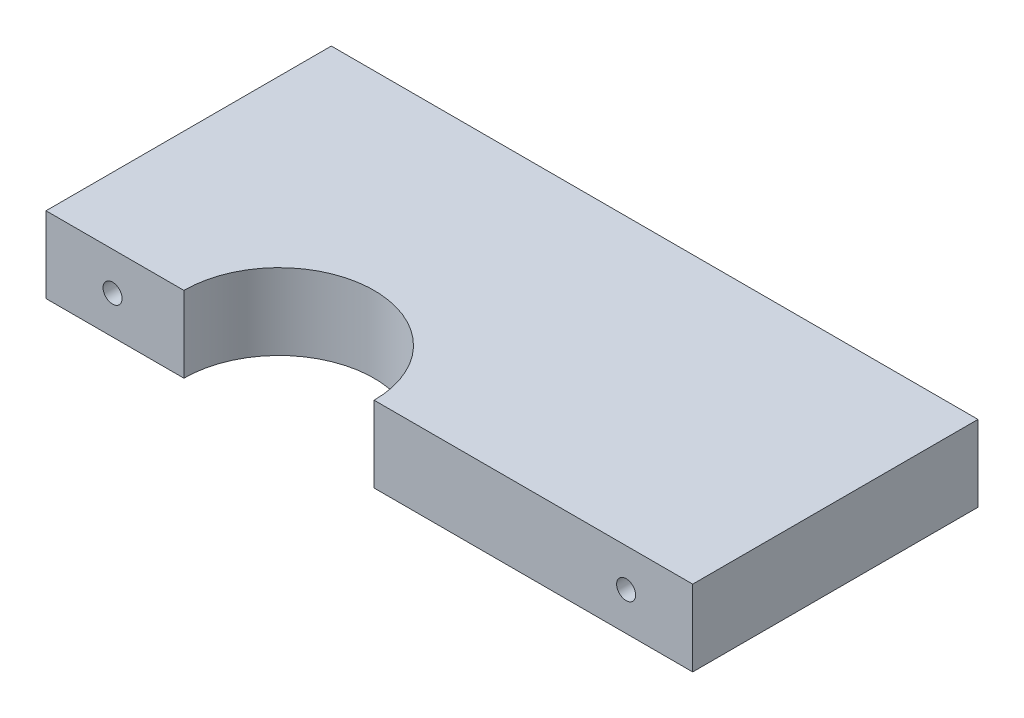
ISO-10303-21;
HEADER;
FILE_DESCRIPTION(('STEP AP214'),'2;1');
FILE_NAME('part.step','',(''),(''),'','','');
FILE_SCHEMA(('AUTOMOTIVE_DESIGN { 1 0 10303 214 1 1 1 1 }'));
ENDSEC;
DATA;
#1=APPLICATION_CONTEXT('core data for automotive mechanical design processes');
#2=APPLICATION_PROTOCOL_DEFINITION('international standard','automotive_design',2000,#1);
#3=PRODUCT_CONTEXT('',#1,'mechanical');
#4=PRODUCT('Part','Part','',(#3));
#5=PRODUCT_RELATED_PRODUCT_CATEGORY('part','',(#4));
#6=PRODUCT_DEFINITION_FORMATION('','',#4);
#7=PRODUCT_DEFINITION_CONTEXT('part definition',#1,'design');
#8=PRODUCT_DEFINITION('design','',#6,#7);
#9=PRODUCT_DEFINITION_SHAPE('','',#8);
#10=(LENGTH_UNIT() NAMED_UNIT(*) SI_UNIT(.MILLI.,.METRE.));
#11=(NAMED_UNIT(*) PLANE_ANGLE_UNIT() SI_UNIT($,.RADIAN.));
#12=(NAMED_UNIT(*) SI_UNIT($,.STERADIAN.) SOLID_ANGLE_UNIT());
#13=UNCERTAINTY_MEASURE_WITH_UNIT(LENGTH_MEASURE(1.E-05),#10,'distance_accuracy_value','');
#14=(GEOMETRIC_REPRESENTATION_CONTEXT(3) GLOBAL_UNCERTAINTY_ASSIGNED_CONTEXT((#13)) GLOBAL_UNIT_ASSIGNED_CONTEXT((#10,
#11,#12)) REPRESENTATION_CONTEXT('',''));
#15=CARTESIAN_POINT('',(0.,0.,0.));
#16=DIRECTION('',(0.,0.,1.));
#17=DIRECTION('',(1.,0.,0.));
#18=AXIS2_PLACEMENT_3D('',#15,#16,#17);
#19=CARTESIAN_POINT('',(-40.9677419354838,8.,-27.2043010752688));
#20=DIRECTION('',(1.,0.,0.));
#21=DIRECTION('',(0.,0.,-1.));
#22=AXIS2_PLACEMENT_3D('',#19,#20,#21);
#23=PLANE('',#22);
#24=DIRECTION('',(0.,0.,1.));
#25=VECTOR('',#24,1.);
#26=CARTESIAN_POINT('',(-40.9677419354838,0.,-27.2043010752688));
#27=LINE('',#26,#25);
#28=CARTESIAN_POINT('',(-40.9677419354838,0.,-27.2043010752688));
#29=VERTEX_POINT('',#28);
#30=CARTESIAN_POINT('',(-40.9677419354838,0.,2.79569892473119));
#31=VERTEX_POINT('',#30);
#32=EDGE_CURVE('E118',#29,#31,#27,.T.);
#33=ORIENTED_EDGE('',*,*,#32,.T.);
#34=DIRECTION('',(0.,-1.,0.));
#35=VECTOR('',#34,1.);
#36=CARTESIAN_POINT('',(-40.9677419354838,8.,2.79569892473119));
#37=LINE('',#36,#35);
#38=CARTESIAN_POINT('',(-40.9677419354838,8.,2.79569892473119));
#39=VERTEX_POINT('',#38);
#40=EDGE_CURVE('E11',#39,#31,#37,.T.);
#41=ORIENTED_EDGE('',*,*,#40,.F.);
#42=DIRECTION('',(0.,0.,1.));
#43=VECTOR('',#42,1.);
#44=CARTESIAN_POINT('',(-40.9677419354838,8.,-27.2043010752688));
#45=LINE('',#44,#43);
#46=CARTESIAN_POINT('',(-40.9677419354838,8.,-27.2043010752688));
#47=VERTEX_POINT('',#46);
#48=EDGE_CURVE('E129',#47,#39,#45,.T.);
#49=ORIENTED_EDGE('',*,*,#48,.F.);
#50=DIRECTION('',(0.,-1.,0.));
#51=VECTOR('',#50,1.);
#52=CARTESIAN_POINT('',(-40.9677419354838,8.,-27.2043010752688));
#53=LINE('',#52,#51);
#54=EDGE_CURVE('E114',#47,#29,#53,.T.);
#55=ORIENTED_EDGE('',*,*,#54,.T.);
#56=EDGE_LOOP('',(#33,#41,#49,#55));
#57=FACE_BOUND('',#56,.T.);
#58=ADVANCED_FACE('F32',(#57),#23,.F.);
#59=CARTESIAN_POINT('',(-40.9677419354838,8.,2.79569892473119));
#60=DIRECTION('',(0.,0.,-1.));
#61=DIRECTION('',(-1.,0.,0.));
#62=AXIS2_PLACEMENT_3D('',#59,#60,#61);
#63=PLANE('',#62);
#64=CARTESIAN_POINT('',(-33.9677419354838,4.,2.79569892473119));
#65=DIRECTION('',(0.,0.,-1.));
#66=DIRECTION('',(-1.,0.,0.));
#67=AXIS2_PLACEMENT_3D('',#64,#65,#66);
#68=CIRCLE('',#67,0.999999999999998);
#69=CARTESIAN_POINT('',(-34.9677419354838,4.,2.79569892473119));
#70=VERTEX_POINT('',#69);
#71=EDGE_CURVE('E122',#70,#70,#68,.T.);
#72=ORIENTED_EDGE('',*,*,#71,.T.);
#73=EDGE_LOOP('',(#72));
#74=FACE_BOUND('',#73,.T.);
#75=DIRECTION('',(1.,0.,0.));
#76=VECTOR('',#75,1.);
#77=CARTESIAN_POINT('',(-40.9677419354838,0.,2.79569892473119));
#78=LINE('',#77,#76);
#79=CARTESIAN_POINT('',(-26.4677419354838,0.,2.79569892473119));
#80=VERTEX_POINT('',#79);
#81=EDGE_CURVE('E121',#31,#80,#78,.T.);
#82=ORIENTED_EDGE('',*,*,#81,.T.);
#83=DIRECTION('',(0.,-1.,0.));
#84=VECTOR('',#83,1.);
#85=CARTESIAN_POINT('',(-26.4677419354838,8.,2.79569892473119));
#86=LINE('',#85,#84);
#87=CARTESIAN_POINT('',(-26.4677419354838,8.,2.79569892473119));
#88=VERTEX_POINT('',#87);
#89=EDGE_CURVE('E41',#88,#80,#86,.T.);
#90=ORIENTED_EDGE('',*,*,#89,.F.);
#91=DIRECTION('',(1.,0.,0.));
#92=VECTOR('',#91,1.);
#93=CARTESIAN_POINT('',(-40.9677419354838,8.,2.79569892473119));
#94=LINE('',#93,#92);
#95=EDGE_CURVE('E87',#39,#88,#94,.T.);
#96=ORIENTED_EDGE('',*,*,#95,.F.);
#97=ORIENTED_EDGE('',*,*,#40,.T.);
#98=EDGE_LOOP('',(#82,#90,#96,#97));
#99=FACE_BOUND('',#98,.T.);
#100=ADVANCED_FACE('F150',(#74,#99),#63,.F.);
#101=CARTESIAN_POINT('',(-16.4677419354838,8.,2.79569892473119));
#102=DIRECTION('',(0.,-1.,0.));
#103=DIRECTION('',(0.,0.,-1.));
#104=AXIS2_PLACEMENT_3D('',#101,#102,#103);
#105=CYLINDRICAL_SURFACE('',#104,10.);
#106=CARTESIAN_POINT('',(-16.4677419354838,0.,2.79569892473119));
#107=DIRECTION('',(0.,-1.,0.));
#108=DIRECTION('',(0.,0.,1.));
#109=AXIS2_PLACEMENT_3D('',#106,#107,#108);
#110=CIRCLE('',#109,10.);
#111=CARTESIAN_POINT('',(-6.46774193548383,0.,2.79569892473119));
#112=VERTEX_POINT('',#111);
#113=EDGE_CURVE('E124',#80,#112,#110,.T.);
#114=ORIENTED_EDGE('',*,*,#113,.T.);
#115=DIRECTION('',(0.,-1.,0.));
#116=VECTOR('',#115,1.);
#117=CARTESIAN_POINT('',(-6.46774193548383,8.,2.79569892473119));
#118=LINE('',#117,#116);
#119=CARTESIAN_POINT('',(-6.46774193548383,8.,2.79569892473119));
#120=VERTEX_POINT('',#119);
#121=EDGE_CURVE('E109',#120,#112,#118,.T.);
#122=ORIENTED_EDGE('',*,*,#121,.F.);
#123=CARTESIAN_POINT('',(-16.4677419354838,8.,2.79569892473119));
#124=DIRECTION('',(0.,-1.,0.));
#125=DIRECTION('',(0.,0.,1.));
#126=AXIS2_PLACEMENT_3D('',#123,#124,#125);
#127=CIRCLE('',#126,10.);
#128=EDGE_CURVE('E100',#88,#120,#127,.T.);
#129=ORIENTED_EDGE('',*,*,#128,.F.);
#130=ORIENTED_EDGE('',*,*,#89,.T.);
#131=EDGE_LOOP('',(#114,#122,#129,#130));
#132=FACE_BOUND('',#131,.T.);
#133=ADVANCED_FACE('F153',(#132),#105,.F.);
#134=CARTESIAN_POINT('',(-6.46774193548383,8.,2.79569892473119));
#135=DIRECTION('',(0.,0.,-1.));
#136=DIRECTION('',(-1.,0.,0.));
#137=AXIS2_PLACEMENT_3D('',#134,#135,#136);
#138=PLANE('',#137);
#139=CARTESIAN_POINT('',(20.0322580645162,4.,2.79569892473119));
#140=DIRECTION('',(0.,0.,-1.));
#141=DIRECTION('',(-1.,0.,0.));
#142=AXIS2_PLACEMENT_3D('',#139,#140,#141);
#143=CIRCLE('',#142,1.);
#144=CARTESIAN_POINT('',(19.0322580645162,4.,2.79569892473119));
#145=VERTEX_POINT('',#144);
#146=EDGE_CURVE('E35',#145,#145,#143,.T.);
#147=ORIENTED_EDGE('',*,*,#146,.T.);
#148=EDGE_LOOP('',(#147));
#149=FACE_BOUND('',#148,.T.);
#150=DIRECTION('',(1.,0.,0.));
#151=VECTOR('',#150,1.);
#152=CARTESIAN_POINT('',(-6.46774193548383,0.,2.79569892473119));
#153=LINE('',#152,#151);
#154=CARTESIAN_POINT('',(27.0322580645162,0.,2.79569892473119));
#155=VERTEX_POINT('',#154);
#156=EDGE_CURVE('E108',#112,#155,#153,.T.);
#157=ORIENTED_EDGE('',*,*,#156,.T.);
#158=DIRECTION('',(0.,-1.,0.));
#159=VECTOR('',#158,1.);
#160=CARTESIAN_POINT('',(27.0322580645162,8.,2.79569892473119));
#161=LINE('',#160,#159);
#162=CARTESIAN_POINT('',(27.0322580645162,8.,2.79569892473119));
#163=VERTEX_POINT('',#162);
#164=EDGE_CURVE('E105',#163,#155,#161,.T.);
#165=ORIENTED_EDGE('',*,*,#164,.F.);
#166=DIRECTION('',(1.,0.,0.));
#167=VECTOR('',#166,1.);
#168=CARTESIAN_POINT('',(-6.46774193548383,8.,2.79569892473119));
#169=LINE('',#168,#167);
#170=EDGE_CURVE('E94',#120,#163,#169,.T.);
#171=ORIENTED_EDGE('',*,*,#170,.F.);
#172=ORIENTED_EDGE('',*,*,#121,.T.);
#173=EDGE_LOOP('',(#157,#165,#171,#172));
#174=FACE_BOUND('',#173,.T.);
#175=ADVANCED_FACE('F106',(#149,#174),#138,.F.);
#176=CARTESIAN_POINT('',(27.0322580645162,8.,-27.2043010752688));
#177=DIRECTION('',(-1.,0.,0.));
#178=DIRECTION('',(0.,0.,1.));
#179=AXIS2_PLACEMENT_3D('',#176,#177,#178);
#180=PLANE('',#179);
#181=DIRECTION('',(0.,0.,-1.));
#182=VECTOR('',#181,1.);
#183=CARTESIAN_POINT('',(27.0322580645162,0.,-27.2043010752688));
#184=LINE('',#183,#182);
#185=CARTESIAN_POINT('',(27.0322580645162,0.,-27.2043010752688));
#186=VERTEX_POINT('',#185);
#187=EDGE_CURVE('E73',#155,#186,#184,.T.);
#188=ORIENTED_EDGE('',*,*,#187,.T.);
#189=DIRECTION('',(0.,-1.,0.));
#190=VECTOR('',#189,1.);
#191=CARTESIAN_POINT('',(27.0322580645162,8.,-27.2043010752688));
#192=LINE('',#191,#190);
#193=CARTESIAN_POINT('',(27.0322580645162,8.,-27.2043010752688));
#194=VERTEX_POINT('',#193);
#195=EDGE_CURVE('E110',#194,#186,#192,.T.);
#196=ORIENTED_EDGE('',*,*,#195,.F.);
#197=DIRECTION('',(0.,0.,-1.));
#198=VECTOR('',#197,1.);
#199=CARTESIAN_POINT('',(27.0322580645162,8.,-27.2043010752688));
#200=LINE('',#199,#198);
#201=EDGE_CURVE('E98',#163,#194,#200,.T.);
#202=ORIENTED_EDGE('',*,*,#201,.F.);
#203=ORIENTED_EDGE('',*,*,#164,.T.);
#204=EDGE_LOOP('',(#188,#196,#202,#203));
#205=FACE_BOUND('',#204,.T.);
#206=ADVANCED_FACE('F112',(#205),#180,.F.);
#207=CARTESIAN_POINT('',(-40.9677419354838,8.,-27.2043010752688));
#208=DIRECTION('',(0.,0.,1.));
#209=DIRECTION('',(1.,0.,0.));
#210=AXIS2_PLACEMENT_3D('',#207,#208,#209);
#211=PLANE('',#210);
#212=CARTESIAN_POINT('',(-30.9677419354838,4.,-27.2043010752688));
#213=DIRECTION('',(0.,0.,1.));
#214=DIRECTION('',(1.,0.,0.));
#215=AXIS2_PLACEMENT_3D('',#212,#213,#214);
#216=CIRCLE('',#215,0.999999999999998);
#217=CARTESIAN_POINT('',(-29.9677419354838,4.,-27.2043010752688));
#218=VERTEX_POINT('',#217);
#219=EDGE_CURVE('E281',#218,#218,#216,.T.);
#220=ORIENTED_EDGE('',*,*,#219,.T.);
#221=EDGE_LOOP('',(#220));
#222=FACE_BOUND('',#221,.T.);
#223=CARTESIAN_POINT('',(17.0322580645162,4.,-27.2043010752688));
#224=DIRECTION('',(0.,0.,1.));
#225=DIRECTION('',(1.,0.,0.));
#226=AXIS2_PLACEMENT_3D('',#223,#224,#225);
#227=CIRCLE('',#226,1.);
#228=CARTESIAN_POINT('',(18.0322580645162,4.,-27.2043010752688));
#229=VERTEX_POINT('',#228);
#230=EDGE_CURVE('E280',#229,#229,#227,.T.);
#231=ORIENTED_EDGE('',*,*,#230,.T.);
#232=EDGE_LOOP('',(#231));
#233=FACE_BOUND('',#232,.T.);
#234=DIRECTION('',(-1.,0.,0.));
#235=VECTOR('',#234,1.);
#236=CARTESIAN_POINT('',(-40.9677419354838,0.,-27.2043010752688));
#237=LINE('',#236,#235);
#238=EDGE_CURVE('E79',#186,#29,#237,.T.);
#239=ORIENTED_EDGE('',*,*,#238,.T.);
#240=ORIENTED_EDGE('',*,*,#54,.F.);
#241=DIRECTION('',(-1.,0.,0.));
#242=VECTOR('',#241,1.);
#243=CARTESIAN_POINT('',(-40.9677419354838,8.,-27.2043010752688));
#244=LINE('',#243,#242);
#245=EDGE_CURVE('E50',#194,#47,#244,.T.);
#246=ORIENTED_EDGE('',*,*,#245,.F.);
#247=ORIENTED_EDGE('',*,*,#195,.T.);
#248=EDGE_LOOP('',(#239,#240,#246,#247));
#249=FACE_BOUND('',#248,.T.);
#250=ADVANCED_FACE('F158',(#222,#233,#249),#211,.F.);
#251=CARTESIAN_POINT('',(-16.4677419354838,8.,2.79569892473119));
#252=DIRECTION('',(0.,1.,0.));
#253=DIRECTION('',(0.,0.,1.));
#254=AXIS2_PLACEMENT_3D('',#251,#252,#253);
#255=PLANE('',#254);
#256=ORIENTED_EDGE('',*,*,#48,.T.);
#257=ORIENTED_EDGE('',*,*,#95,.T.);
#258=ORIENTED_EDGE('',*,*,#128,.T.);
#259=ORIENTED_EDGE('',*,*,#170,.T.);
#260=ORIENTED_EDGE('',*,*,#201,.T.);
#261=ORIENTED_EDGE('',*,*,#245,.T.);
#262=EDGE_LOOP('',(#256,#257,#258,#259,#260,#261));
#263=FACE_BOUND('',#262,.T.);
#264=ADVANCED_FACE('F96',(#263),#255,.T.);
#265=CARTESIAN_POINT('',(-16.4677419354838,0.,2.79569892473119));
#266=DIRECTION('',(0.,1.,0.));
#267=DIRECTION('',(0.,0.,1.));
#268=AXIS2_PLACEMENT_3D('',#265,#266,#267);
#269=PLANE('',#268);
#270=ORIENTED_EDGE('',*,*,#32,.F.);
#271=ORIENTED_EDGE('',*,*,#238,.F.);
#272=ORIENTED_EDGE('',*,*,#187,.F.);
#273=ORIENTED_EDGE('',*,*,#156,.F.);
#274=ORIENTED_EDGE('',*,*,#113,.F.);
#275=ORIENTED_EDGE('',*,*,#81,.F.);
#276=EDGE_LOOP('',(#270,#271,#272,#273,#274,#275));
#277=FACE_BOUND('',#276,.T.);
#278=ADVANCED_FACE('F156',(#277),#269,.F.);
#279=CARTESIAN_POINT('',(-33.9677419354838,4.,-1.));
#280=DIRECTION('',(0.,0.,1.));
#281=DIRECTION('',(1.,0.,0.));
#282=AXIS2_PLACEMENT_3D('',#279,#280,#281);
#283=CYLINDRICAL_SURFACE('',#282,0.999999999999998);
#284=CARTESIAN_POINT('',(-33.9677419354838,4.,-1.));
#285=DIRECTION('',(0.,0.,1.));
#286=DIRECTION('',(1.,0.,0.));
#287=AXIS2_PLACEMENT_3D('',#284,#285,#286);
#288=CIRCLE('',#287,0.999999999999998);
#289=CARTESIAN_POINT('',(-32.9677419354838,4.,-1.));
#290=VERTEX_POINT('',#289);
#291=EDGE_CURVE('E135',#290,#290,#288,.T.);
#292=ORIENTED_EDGE('',*,*,#291,.F.);
#293=EDGE_LOOP('',(#292));
#294=FACE_BOUND('',#293,.T.);
#295=ORIENTED_EDGE('',*,*,#71,.F.);
#296=EDGE_LOOP('',(#295));
#297=FACE_BOUND('',#296,.T.);
#298=ADVANCED_FACE('F199',(#294,#297),#283,.F.);
#299=CARTESIAN_POINT('',(-33.9677419354838,4.,-1.));
#300=DIRECTION('',(0.,0.,1.));
#301=DIRECTION('',(1.,0.,0.));
#302=AXIS2_PLACEMENT_3D('',#299,#300,#301);
#303=PLANE('',#302);
#304=ORIENTED_EDGE('',*,*,#291,.T.);
#305=EDGE_LOOP('',(#304));
#306=FACE_BOUND('',#305,.T.);
#307=ADVANCED_FACE('F189',(#306),#303,.T.);
#308=CARTESIAN_POINT('',(20.0322580645162,4.,-1.));
#309=DIRECTION('',(0.,0.,1.));
#310=DIRECTION('',(1.,0.,0.));
#311=AXIS2_PLACEMENT_3D('',#308,#309,#310);
#312=CYLINDRICAL_SURFACE('',#311,1.);
#313=CARTESIAN_POINT('',(20.0322580645162,4.,-1.));
#314=DIRECTION('',(0.,0.,1.));
#315=DIRECTION('',(1.,0.,0.));
#316=AXIS2_PLACEMENT_3D('',#313,#314,#315);
#317=CIRCLE('',#316,1.);
#318=CARTESIAN_POINT('',(21.0322580645162,4.,-1.));
#319=VERTEX_POINT('',#318);
#320=EDGE_CURVE('E143',#319,#319,#317,.T.);
#321=ORIENTED_EDGE('',*,*,#320,.F.);
#322=EDGE_LOOP('',(#321));
#323=FACE_BOUND('',#322,.T.);
#324=ORIENTED_EDGE('',*,*,#146,.F.);
#325=EDGE_LOOP('',(#324));
#326=FACE_BOUND('',#325,.T.);
#327=ADVANCED_FACE('F186',(#323,#326),#312,.F.);
#328=CARTESIAN_POINT('',(20.0322580645162,4.,-1.));
#329=DIRECTION('',(0.,0.,1.));
#330=DIRECTION('',(1.,0.,0.));
#331=AXIS2_PLACEMENT_3D('',#328,#329,#330);
#332=PLANE('',#331);
#333=ORIENTED_EDGE('',*,*,#320,.T.);
#334=EDGE_LOOP('',(#333));
#335=FACE_BOUND('',#334,.T.);
#336=ADVANCED_FACE('F188',(#335),#332,.T.);
#337=CARTESIAN_POINT('',(17.0322580645162,4.,-17.2043010752688));
#338=DIRECTION('',(0.,0.,-1.));
#339=DIRECTION('',(-1.,0.,0.));
#340=AXIS2_PLACEMENT_3D('',#337,#338,#339);
#341=CYLINDRICAL_SURFACE('',#340,1.);
#342=CARTESIAN_POINT('',(17.0322580645162,4.,-17.2043010752688));
#343=DIRECTION('',(0.,0.,1.));
#344=DIRECTION('',(1.,0.,0.));
#345=AXIS2_PLACEMENT_3D('',#342,#343,#344);
#346=CIRCLE('',#345,1.);
#347=CARTESIAN_POINT('',(18.0322580645162,4.,-17.2043010752688));
#348=VERTEX_POINT('',#347);
#349=EDGE_CURVE('E284',#348,#348,#346,.T.);
#350=ORIENTED_EDGE('',*,*,#349,.T.);
#351=EDGE_LOOP('',(#350));
#352=FACE_BOUND('',#351,.T.);
#353=ORIENTED_EDGE('',*,*,#230,.F.);
#354=EDGE_LOOP('',(#353));
#355=FACE_BOUND('',#354,.T.);
#356=ADVANCED_FACE('F196',(#352,#355),#341,.F.);
#357=CARTESIAN_POINT('',(17.0322580645162,4.,-17.2043010752688));
#358=DIRECTION('',(0.,0.,1.));
#359=DIRECTION('',(1.,0.,0.));
#360=AXIS2_PLACEMENT_3D('',#357,#358,#359);
#361=PLANE('',#360);
#362=ORIENTED_EDGE('',*,*,#349,.F.);
#363=EDGE_LOOP('',(#362));
#364=FACE_BOUND('',#363,.T.);
#365=ADVANCED_FACE('F244',(#364),#361,.F.);
#366=CARTESIAN_POINT('',(-30.9677419354838,4.,-17.2043010752688));
#367=DIRECTION('',(0.,0.,-1.));
#368=DIRECTION('',(-1.,0.,0.));
#369=AXIS2_PLACEMENT_3D('',#366,#367,#368);
#370=CYLINDRICAL_SURFACE('',#369,0.999999999999998);
#371=CARTESIAN_POINT('',(-30.9677419354838,4.,-17.2043010752688));
#372=DIRECTION('',(0.,0.,1.));
#373=DIRECTION('',(1.,0.,0.));
#374=AXIS2_PLACEMENT_3D('',#371,#372,#373);
#375=CIRCLE('',#374,0.999999999999998);
#376=CARTESIAN_POINT('',(-29.9677419354838,4.,-17.2043010752688));
#377=VERTEX_POINT('',#376);
#378=EDGE_CURVE('E279',#377,#377,#375,.T.);
#379=ORIENTED_EDGE('',*,*,#378,.T.);
#380=EDGE_LOOP('',(#379));
#381=FACE_BOUND('',#380,.T.);
#382=ORIENTED_EDGE('',*,*,#219,.F.);
#383=EDGE_LOOP('',(#382));
#384=FACE_BOUND('',#383,.T.);
#385=ADVANCED_FACE('F253',(#381,#384),#370,.F.);
#386=CARTESIAN_POINT('',(-30.9677419354838,4.,-17.2043010752688));
#387=DIRECTION('',(0.,0.,1.));
#388=DIRECTION('',(1.,0.,0.));
#389=AXIS2_PLACEMENT_3D('',#386,#387,#388);
#390=PLANE('',#389);
#391=ORIENTED_EDGE('',*,*,#378,.F.);
#392=EDGE_LOOP('',(#391));
#393=FACE_BOUND('',#392,.T.);
#394=ADVANCED_FACE('F263',(#393),#390,.F.);
#395=CLOSED_SHELL('',(#58,#100,#133,#175,#206,#250,#264,#278,#298,#307,#327,#336,#356,#365,#385,#394));
#396=MANIFOLD_SOLID_BREP('B2',#395);
#397=ADVANCED_BREP_SHAPE_REPRESENTATION('',(#18,#396),#14);
#398=SHAPE_DEFINITION_REPRESENTATION(#9,#397);
ENDSEC;
END-ISO-10303-21;
